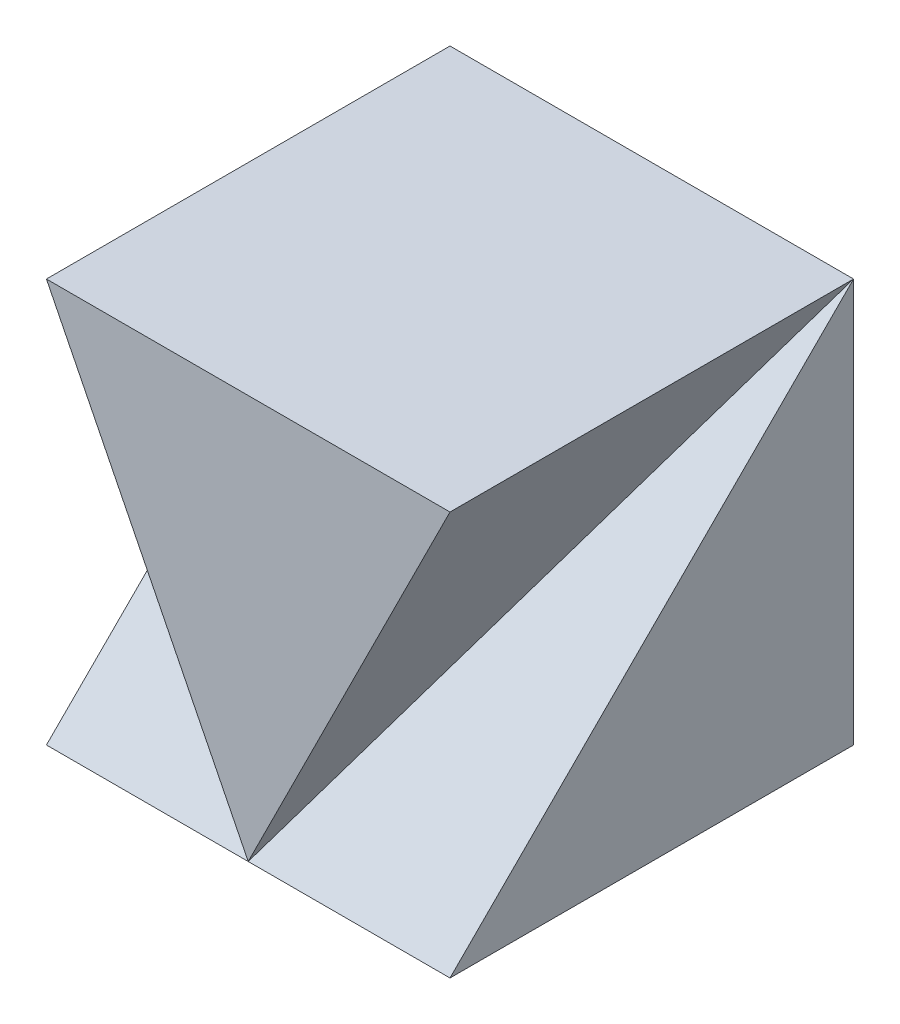
ISO-10303-21;
HEADER;
FILE_DESCRIPTION(('STEP AP214'),'2;1');
FILE_NAME('part.step','',(''),(''),'','','');
FILE_SCHEMA(('AUTOMOTIVE_DESIGN { 1 0 10303 214 1 1 1 1 }'));
ENDSEC;
DATA;
#1=APPLICATION_CONTEXT('core data for automotive mechanical design processes');
#2=APPLICATION_PROTOCOL_DEFINITION('international standard','automotive_design',2000,#1);
#3=PRODUCT_CONTEXT('',#1,'mechanical');
#4=PRODUCT('Part','Part','',(#3));
#5=PRODUCT_RELATED_PRODUCT_CATEGORY('part','',(#4));
#6=PRODUCT_DEFINITION_FORMATION('','',#4);
#7=PRODUCT_DEFINITION_CONTEXT('part definition',#1,'design');
#8=PRODUCT_DEFINITION('design','',#6,#7);
#9=PRODUCT_DEFINITION_SHAPE('','',#8);
#10=(LENGTH_UNIT() NAMED_UNIT(*) SI_UNIT(.MILLI.,.METRE.));
#11=(NAMED_UNIT(*) PLANE_ANGLE_UNIT() SI_UNIT($,.RADIAN.));
#12=(NAMED_UNIT(*) SI_UNIT($,.STERADIAN.) SOLID_ANGLE_UNIT());
#13=UNCERTAINTY_MEASURE_WITH_UNIT(LENGTH_MEASURE(1.E-05),#10,'distance_accuracy_value','');
#14=(GEOMETRIC_REPRESENTATION_CONTEXT(3) GLOBAL_UNCERTAINTY_ASSIGNED_CONTEXT((#13)) GLOBAL_UNIT_ASSIGNED_CONTEXT((#10,
#11,#12)) REPRESENTATION_CONTEXT('',''));
#15=CARTESIAN_POINT('',(0.,0.,0.));
#16=DIRECTION('',(0.,0.,1.));
#17=DIRECTION('',(1.,0.,0.));
#18=AXIS2_PLACEMENT_3D('',#15,#16,#17);
#19=CARTESIAN_POINT('',(2.,4.,2.));
#20=DIRECTION('',(-1.,0.,0.));
#21=DIRECTION('',(0.,0.,1.));
#22=AXIS2_PLACEMENT_3D('',#19,#20,#21);
#23=PLANE('',#22);
#24=DIRECTION('',(0.,0.707106781186548,-0.707106781186548));
#25=VECTOR('',#24,1.);
#26=CARTESIAN_POINT('',(2.,2.,0.));
#27=LINE('',#26,#25);
#28=CARTESIAN_POINT('',(2.,0.,2.));
#29=VERTEX_POINT('',#28);
#30=CARTESIAN_POINT('',(2.,4.,-2.));
#31=VERTEX_POINT('',#30);
#32=EDGE_CURVE('E80',#29,#31,#27,.T.);
#33=ORIENTED_EDGE('',*,*,#32,.F.);
#34=DIRECTION('',(0.,0.,-1.));
#35=VECTOR('',#34,1.);
#36=CARTESIAN_POINT('',(2.,0.,2.));
#37=LINE('',#36,#35);
#38=CARTESIAN_POINT('',(2.,0.,-2.));
#39=VERTEX_POINT('',#38);
#40=EDGE_CURVE('E115',#29,#39,#37,.T.);
#41=ORIENTED_EDGE('',*,*,#40,.T.);
#42=DIRECTION('',(0.,-1.,0.));
#43=VECTOR('',#42,1.);
#44=CARTESIAN_POINT('',(2.,4.,-2.));
#45=LINE('',#44,#43);
#46=EDGE_CURVE('E12',#31,#39,#45,.T.);
#47=ORIENTED_EDGE('',*,*,#46,.F.);
#48=EDGE_LOOP('',(#33,#41,#47));
#49=FACE_BOUND('',#48,.T.);
#50=ADVANCED_FACE('F35',(#49),#23,.F.);
#51=CARTESIAN_POINT('',(-2.,4.,2.));
#52=DIRECTION('',(1.,0.,0.));
#53=DIRECTION('',(0.,0.,-1.));
#54=AXIS2_PLACEMENT_3D('',#51,#52,#53);
#55=PLANE('',#54);
#56=DIRECTION('',(0.,-0.707106781186548,0.707106781186548));
#57=VECTOR('',#56,1.);
#58=CARTESIAN_POINT('',(-2.,2.,0.));
#59=LINE('',#58,#57);
#60=CARTESIAN_POINT('',(-2.,4.,-2.));
#61=VERTEX_POINT('',#60);
#62=CARTESIAN_POINT('',(-2.,0.,2.));
#63=VERTEX_POINT('',#62);
#64=EDGE_CURVE('E50',#61,#63,#59,.T.);
#65=ORIENTED_EDGE('',*,*,#64,.F.);
#66=DIRECTION('',(0.,-1.,0.));
#67=VECTOR('',#66,1.);
#68=CARTESIAN_POINT('',(-2.,4.,-2.));
#69=LINE('',#68,#67);
#70=CARTESIAN_POINT('',(-2.,0.,-2.));
#71=VERTEX_POINT('',#70);
#72=EDGE_CURVE('E43',#61,#71,#69,.T.);
#73=ORIENTED_EDGE('',*,*,#72,.T.);
#74=DIRECTION('',(0.,0.,1.));
#75=VECTOR('',#74,1.);
#76=CARTESIAN_POINT('',(-2.,0.,2.));
#77=LINE('',#76,#75);
#78=EDGE_CURVE('E118',#71,#63,#77,.T.);
#79=ORIENTED_EDGE('',*,*,#78,.T.);
#80=EDGE_LOOP('',(#65,#73,#79));
#81=FACE_BOUND('',#80,.T.);
#82=ADVANCED_FACE('F145',(#81),#55,.F.);
#83=CARTESIAN_POINT('',(-2.,4.,2.));
#84=DIRECTION('',(0.,0.,-1.));
#85=DIRECTION('',(-1.,0.,0.));
#86=AXIS2_PLACEMENT_3D('',#83,#84,#85);
#87=PLANE('',#86);
#88=DIRECTION('',(0.447213595499958,-0.894427190999916,0.));
#89=VECTOR('',#88,1.);
#90=CARTESIAN_POINT('',(0.,0.,2.));
#91=LINE('',#90,#89);
#92=CARTESIAN_POINT('',(-2.,4.,2.));
#93=VERTEX_POINT('',#92);
#94=CARTESIAN_POINT('',(0.,0.,2.));
#95=VERTEX_POINT('',#94);
#96=EDGE_CURVE('E91',#93,#95,#91,.T.);
#97=ORIENTED_EDGE('',*,*,#96,.T.);
#98=DIRECTION('',(0.447213595499958,0.894427190999916,0.));
#99=VECTOR('',#98,1.);
#100=CARTESIAN_POINT('',(0.,0.,2.));
#101=LINE('',#100,#99);
#102=CARTESIAN_POINT('',(2.,4.,2.));
#103=VERTEX_POINT('',#102);
#104=EDGE_CURVE('E99',#95,#103,#101,.T.);
#105=ORIENTED_EDGE('',*,*,#104,.T.);
#106=DIRECTION('',(1.,0.,0.));
#107=VECTOR('',#106,1.);
#108=CARTESIAN_POINT('',(-2.,4.,2.));
#109=LINE('',#108,#107);
#110=EDGE_CURVE('E112',#93,#103,#109,.T.);
#111=ORIENTED_EDGE('',*,*,#110,.F.);
#112=EDGE_LOOP('',(#97,#105,#111));
#113=FACE_BOUND('',#112,.T.);
#114=ADVANCED_FACE('F151',(#113),#87,.F.);
#115=CARTESIAN_POINT('',(-2.,4.,-2.));
#116=DIRECTION('',(0.,0.,1.));
#117=DIRECTION('',(1.,0.,0.));
#118=AXIS2_PLACEMENT_3D('',#115,#116,#117);
#119=PLANE('',#118);
#120=DIRECTION('',(-1.,0.,0.));
#121=VECTOR('',#120,1.);
#122=CARTESIAN_POINT('',(-2.,0.,-2.));
#123=LINE('',#122,#121);
#124=EDGE_CURVE('E57',#39,#71,#123,.T.);
#125=ORIENTED_EDGE('',*,*,#124,.T.);
#126=ORIENTED_EDGE('',*,*,#72,.F.);
#127=DIRECTION('',(-1.,0.,0.));
#128=VECTOR('',#127,1.);
#129=CARTESIAN_POINT('',(-2.,4.,-2.));
#130=LINE('',#129,#128);
#131=EDGE_CURVE('E103',#31,#61,#130,.T.);
#132=ORIENTED_EDGE('',*,*,#131,.F.);
#133=ORIENTED_EDGE('',*,*,#46,.T.);
#134=EDGE_LOOP('',(#125,#126,#132,#133));
#135=FACE_BOUND('',#134,.T.);
#136=ADVANCED_FACE('F104',(#135),#119,.F.);
#137=CARTESIAN_POINT('',(0.,4.,0.));
#138=DIRECTION('',(0.,-1.,0.));
#139=DIRECTION('',(0.,0.,-1.));
#140=AXIS2_PLACEMENT_3D('',#137,#138,#139);
#141=PLANE('',#140);
#142=DIRECTION('',(0.,0.,-1.));
#143=VECTOR('',#142,1.);
#144=CARTESIAN_POINT('',(2.,4.,2.));
#145=LINE('',#144,#143);
#146=EDGE_CURVE('E97',#103,#31,#145,.T.);
#147=ORIENTED_EDGE('',*,*,#146,.T.);
#148=ORIENTED_EDGE('',*,*,#131,.T.);
#149=DIRECTION('',(0.,0.,1.));
#150=VECTOR('',#149,1.);
#151=CARTESIAN_POINT('',(-2.,4.,2.));
#152=LINE('',#151,#150);
#153=EDGE_CURVE('E107',#61,#93,#152,.T.);
#154=ORIENTED_EDGE('',*,*,#153,.T.);
#155=ORIENTED_EDGE('',*,*,#110,.T.);
#156=EDGE_LOOP('',(#147,#148,#154,#155));
#157=FACE_BOUND('',#156,.T.);
#158=ADVANCED_FACE('F110',(#157),#141,.F.);
#159=CARTESIAN_POINT('',(0.,0.,0.));
#160=DIRECTION('',(0.,-1.,0.));
#161=DIRECTION('',(0.,0.,-1.));
#162=AXIS2_PLACEMENT_3D('',#159,#160,#161);
#163=PLANE('',#162);
#164=ORIENTED_EDGE('',*,*,#40,.F.);
#165=DIRECTION('',(1.,0.,0.));
#166=VECTOR('',#165,1.);
#167=CARTESIAN_POINT('',(-2.,0.,2.));
#168=LINE('',#167,#166);
#169=EDGE_CURVE('E86',#95,#29,#168,.T.);
#170=ORIENTED_EDGE('',*,*,#169,.F.);
#171=EDGE_CURVE('E113',#63,#95,#168,.T.);
#172=ORIENTED_EDGE('',*,*,#171,.F.);
#173=ORIENTED_EDGE('',*,*,#78,.F.);
#174=ORIENTED_EDGE('',*,*,#124,.F.);
#175=EDGE_LOOP('',(#164,#170,#172,#173,#174));
#176=FACE_BOUND('',#175,.T.);
#177=ADVANCED_FACE('F147',(#176),#163,.T.);
#178=CARTESIAN_POINT('',(0.,0.,2.));
#179=DIRECTION('',(0.,0.707106781186548,0.707106781186548));
#180=DIRECTION('',(0.,-0.707106781186548,0.707106781186548));
#181=AXIS2_PLACEMENT_3D('',#178,#179,#180);
#182=PLANE('',#181);
#183=ORIENTED_EDGE('',*,*,#64,.T.);
#184=ORIENTED_EDGE('',*,*,#171,.T.);
#185=DIRECTION('',(-0.333333333333333,0.666666666666667,-0.666666666666667));
#186=VECTOR('',#185,1.);
#187=CARTESIAN_POINT('',(0.,0.,2.));
#188=LINE('',#187,#186);
#189=EDGE_CURVE('E120',#95,#61,#188,.T.);
#190=ORIENTED_EDGE('',*,*,#189,.T.);
#191=EDGE_LOOP('',(#183,#184,#190));
#192=FACE_BOUND('',#191,.T.);
#193=ADVANCED_FACE('F149',(#192),#182,.T.);
#194=CARTESIAN_POINT('',(0.,0.,0.));
#195=DIRECTION('',(-0.894427190999916,-0.447213595499959,0.));
#196=DIRECTION('',(0.447213595499959,-0.894427190999916,0.));
#197=AXIS2_PLACEMENT_3D('',#194,#195,#196);
#198=PLANE('',#197);
#199=ORIENTED_EDGE('',*,*,#189,.F.);
#200=ORIENTED_EDGE('',*,*,#96,.F.);
#201=ORIENTED_EDGE('',*,*,#153,.F.);
#202=EDGE_LOOP('',(#199,#200,#201));
#203=FACE_BOUND('',#202,.T.);
#204=ADVANCED_FACE('F166',(#203),#198,.T.);
#205=CARTESIAN_POINT('',(2.,4.,-2.));
#206=DIRECTION('',(0.,0.707106781186548,0.707106781186548));
#207=DIRECTION('',(0.,-0.707106781186548,0.707106781186548));
#208=AXIS2_PLACEMENT_3D('',#205,#206,#207);
#209=PLANE('',#208);
#210=ORIENTED_EDGE('',*,*,#32,.T.);
#211=DIRECTION('',(-0.333333333333333,-0.666666666666667,0.666666666666667));
#212=VECTOR('',#211,1.);
#213=CARTESIAN_POINT('',(2.,4.,-2.));
#214=LINE('',#213,#212);
#215=EDGE_CURVE('E83',#31,#95,#214,.T.);
#216=ORIENTED_EDGE('',*,*,#215,.T.);
#217=ORIENTED_EDGE('',*,*,#169,.T.);
#218=EDGE_LOOP('',(#210,#216,#217));
#219=FACE_BOUND('',#218,.T.);
#220=ADVANCED_FACE('F82',(#219),#209,.T.);
#221=CARTESIAN_POINT('',(0.,0.,0.));
#222=DIRECTION('',(-0.894427190999916,0.447213595499957,0.));
#223=DIRECTION('',(-0.447213595499957,-0.894427190999916,0.));
#224=AXIS2_PLACEMENT_3D('',#221,#222,#223);
#225=PLANE('',#224);
#226=ORIENTED_EDGE('',*,*,#146,.F.);
#227=ORIENTED_EDGE('',*,*,#104,.F.);
#228=ORIENTED_EDGE('',*,*,#215,.F.);
#229=EDGE_LOOP('',(#226,#227,#228));
#230=FACE_BOUND('',#229,.T.);
#231=ADVANCED_FACE('F95',(#230),#225,.F.);
#232=CLOSED_SHELL('',(#50,#82,#114,#136,#158,#177,#193,#204,#220,#231));
#233=MANIFOLD_SOLID_BREP('B2',#232);
#234=ADVANCED_BREP_SHAPE_REPRESENTATION('',(#18,#233),#14);
#235=SHAPE_DEFINITION_REPRESENTATION(#9,#234);
ENDSEC;
END-ISO-10303-21;
